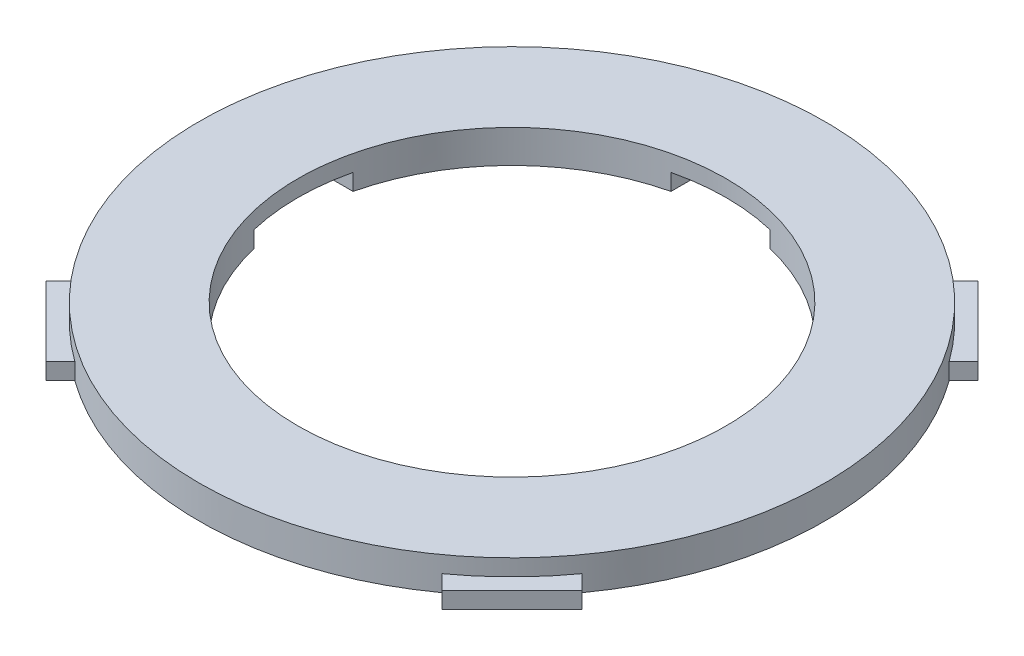
ISO-10303-21;
HEADER;
FILE_DESCRIPTION(('STEP AP214'),'2;1');
FILE_NAME('part.step','',(''),(''),'','','');
FILE_SCHEMA(('AUTOMOTIVE_DESIGN { 1 0 10303 214 1 1 1 1 }'));
ENDSEC;
DATA;
#1=APPLICATION_CONTEXT('core data for automotive mechanical design processes');
#2=APPLICATION_PROTOCOL_DEFINITION('international standard','automotive_design',2000,#1);
#3=PRODUCT_CONTEXT('',#1,'mechanical');
#4=PRODUCT('Part','Part','',(#3));
#5=PRODUCT_RELATED_PRODUCT_CATEGORY('part','',(#4));
#6=PRODUCT_DEFINITION_FORMATION('','',#4);
#7=PRODUCT_DEFINITION_CONTEXT('part definition',#1,'design');
#8=PRODUCT_DEFINITION('design','',#6,#7);
#9=PRODUCT_DEFINITION_SHAPE('','',#8);
#10=(LENGTH_UNIT() NAMED_UNIT(*) SI_UNIT(.MILLI.,.METRE.));
#11=(NAMED_UNIT(*) PLANE_ANGLE_UNIT() SI_UNIT($,.RADIAN.));
#12=(NAMED_UNIT(*) SI_UNIT($,.STERADIAN.) SOLID_ANGLE_UNIT());
#13=UNCERTAINTY_MEASURE_WITH_UNIT(LENGTH_MEASURE(1.E-05),#10,'distance_accuracy_value','');
#14=(GEOMETRIC_REPRESENTATION_CONTEXT(3) GLOBAL_UNCERTAINTY_ASSIGNED_CONTEXT((#13)) GLOBAL_UNIT_ASSIGNED_CONTEXT((#10,
#11,#12)) REPRESENTATION_CONTEXT('',''));
#15=CARTESIAN_POINT('',(0.,0.,0.));
#16=DIRECTION('',(0.,0.,1.));
#17=DIRECTION('',(1.,0.,0.));
#18=AXIS2_PLACEMENT_3D('',#15,#16,#17);
#19=CARTESIAN_POINT('',(15.,10.,0.));
#20=DIRECTION('',(-1.,0.,0.));
#21=DIRECTION('',(0.,0.,1.));
#22=AXIS2_PLACEMENT_3D('',#19,#20,#21);
#23=PLANE('',#22);
#24=DIRECTION('',(0.,-1.,0.));
#25=VECTOR('',#24,1.);
#26=CARTESIAN_POINT('',(15.,10.,70.));
#27=LINE('',#26,#25);
#28=CARTESIAN_POINT('',(15.,5.,70.));
#29=VERTEX_POINT('',#28);
#30=CARTESIAN_POINT('',(15.,0.,70.));
#31=VERTEX_POINT('',#30);
#32=EDGE_CURVE('E53',#29,#31,#27,.T.);
#33=ORIENTED_EDGE('',*,*,#32,.F.);
#34=DIRECTION('',(0.,0.,-1.));
#35=VECTOR('',#34,1.);
#36=CARTESIAN_POINT('',(15.,5.,0.));
#37=LINE('',#36,#35);
#38=CARTESIAN_POINT('',(15.,5.,63.2455532033676));
#39=VERTEX_POINT('',#38);
#40=EDGE_CURVE('E59',#29,#39,#37,.T.);
#41=ORIENTED_EDGE('',*,*,#40,.T.);
#42=DIRECTION('',(0.,-1.,0.));
#43=VECTOR('',#42,1.);
#44=CARTESIAN_POINT('',(15.,10.,63.2455532033676));
#45=LINE('',#44,#43);
#46=CARTESIAN_POINT('',(15.,0.,63.2455532033676));
#47=VERTEX_POINT('',#46);
#48=EDGE_CURVE('E11',#39,#47,#45,.T.);
#49=ORIENTED_EDGE('',*,*,#48,.T.);
#50=DIRECTION('',(0.,0.,-1.));
#51=VECTOR('',#50,1.);
#52=CARTESIAN_POINT('',(15.,0.,0.));
#53=LINE('',#52,#51);
#54=EDGE_CURVE('E442',#31,#47,#53,.T.);
#55=ORIENTED_EDGE('',*,*,#54,.F.);
#56=EDGE_LOOP('',(#33,#41,#49,#55));
#57=FACE_BOUND('',#56,.T.);
#58=ADVANCED_FACE('F45',(#57),#23,.T.);
#59=CARTESIAN_POINT('',(0.,10.,70.));
#60=DIRECTION('',(0.,0.,1.));
#61=DIRECTION('',(1.,0.,0.));
#62=AXIS2_PLACEMENT_3D('',#59,#60,#61);
#63=PLANE('',#62);
#64=DIRECTION('',(-1.,0.,0.));
#65=VECTOR('',#64,1.);
#66=CARTESIAN_POINT('',(0.,5.,70.));
#67=LINE('',#66,#65);
#68=CARTESIAN_POINT('',(-15.,5.,70.));
#69=VERTEX_POINT('',#68);
#70=EDGE_CURVE('E67',#29,#69,#67,.T.);
#71=ORIENTED_EDGE('',*,*,#70,.F.);
#72=ORIENTED_EDGE('',*,*,#32,.T.);
#73=DIRECTION('',(-1.,0.,0.));
#74=VECTOR('',#73,1.);
#75=CARTESIAN_POINT('',(0.,0.,70.));
#76=LINE('',#75,#74);
#77=CARTESIAN_POINT('',(-15.,0.,70.));
#78=VERTEX_POINT('',#77);
#79=EDGE_CURVE('E448',#31,#78,#76,.T.);
#80=ORIENTED_EDGE('',*,*,#79,.T.);
#81=DIRECTION('',(0.,-1.,0.));
#82=VECTOR('',#81,1.);
#83=CARTESIAN_POINT('',(-15.,10.,70.));
#84=LINE('',#83,#82);
#85=EDGE_CURVE('E535',#69,#78,#84,.T.);
#86=ORIENTED_EDGE('',*,*,#85,.F.);
#87=EDGE_LOOP('',(#71,#72,#80,#86));
#88=FACE_BOUND('',#87,.T.);
#89=ADVANCED_FACE('F539',(#88),#63,.F.);
#90=CARTESIAN_POINT('',(-15.,10.,0.));
#91=DIRECTION('',(-1.,0.,0.));
#92=DIRECTION('',(0.,0.,1.));
#93=AXIS2_PLACEMENT_3D('',#90,#91,#92);
#94=PLANE('',#93);
#95=DIRECTION('',(0.,0.,-1.));
#96=VECTOR('',#95,1.);
#97=CARTESIAN_POINT('',(-15.,5.,0.));
#98=LINE('',#97,#96);
#99=CARTESIAN_POINT('',(-15.,5.,63.2455532033676));
#100=VERTEX_POINT('',#99);
#101=EDGE_CURVE('E1010',#69,#100,#98,.T.);
#102=ORIENTED_EDGE('',*,*,#101,.F.);
#103=ORIENTED_EDGE('',*,*,#85,.T.);
#104=DIRECTION('',(0.,0.,-1.));
#105=VECTOR('',#104,1.);
#106=CARTESIAN_POINT('',(-15.,0.,0.));
#107=LINE('',#106,#105);
#108=CARTESIAN_POINT('',(-15.,0.,63.2455532033676));
#109=VERTEX_POINT('',#108);
#110=EDGE_CURVE('E452',#78,#109,#107,.T.);
#111=ORIENTED_EDGE('',*,*,#110,.T.);
#112=DIRECTION('',(0.,-1.,0.));
#113=VECTOR('',#112,1.);
#114=CARTESIAN_POINT('',(-15.,10.,63.2455532033676));
#115=LINE('',#114,#113);
#116=EDGE_CURVE('E532',#100,#109,#115,.T.);
#117=ORIENTED_EDGE('',*,*,#116,.F.);
#118=EDGE_LOOP('',(#102,#103,#111,#117));
#119=FACE_BOUND('',#118,.T.);
#120=ADVANCED_FACE('F627',(#119),#94,.F.);
#121=CARTESIAN_POINT('',(0.,10.,15.));
#122=DIRECTION('',(0.,0.,-1.));
#123=DIRECTION('',(-1.,0.,0.));
#124=AXIS2_PLACEMENT_3D('',#121,#122,#123);
#125=PLANE('',#124);
#126=DIRECTION('',(0.,-1.,0.));
#127=VECTOR('',#126,1.);
#128=CARTESIAN_POINT('',(-70.,10.,15.));
#129=LINE('',#128,#127);
#130=CARTESIAN_POINT('',(-70.,5.,15.));
#131=VERTEX_POINT('',#130);
#132=CARTESIAN_POINT('',(-70.,0.,15.));
#133=VERTEX_POINT('',#132);
#134=EDGE_CURVE('E526',#131,#133,#129,.T.);
#135=ORIENTED_EDGE('',*,*,#134,.F.);
#136=DIRECTION('',(1.,0.,0.));
#137=VECTOR('',#136,1.);
#138=CARTESIAN_POINT('',(0.,5.,15.));
#139=LINE('',#138,#137);
#140=CARTESIAN_POINT('',(-63.2455532033676,5.,15.));
#141=VERTEX_POINT('',#140);
#142=EDGE_CURVE('E369',#131,#141,#139,.T.);
#143=ORIENTED_EDGE('',*,*,#142,.T.);
#144=DIRECTION('',(0.,-1.,0.));
#145=VECTOR('',#144,1.);
#146=CARTESIAN_POINT('',(-63.2455532033676,10.,15.));
#147=LINE('',#146,#145);
#148=CARTESIAN_POINT('',(-63.2455532033676,0.,15.));
#149=VERTEX_POINT('',#148);
#150=EDGE_CURVE('E529',#141,#149,#147,.T.);
#151=ORIENTED_EDGE('',*,*,#150,.T.);
#152=DIRECTION('',(1.,0.,0.));
#153=VECTOR('',#152,1.);
#154=CARTESIAN_POINT('',(0.,0.,15.));
#155=LINE('',#154,#153);
#156=EDGE_CURVE('E456',#133,#149,#155,.T.);
#157=ORIENTED_EDGE('',*,*,#156,.F.);
#158=EDGE_LOOP('',(#135,#143,#151,#157));
#159=FACE_BOUND('',#158,.T.);
#160=ADVANCED_FACE('F631',(#159),#125,.T.);
#161=CARTESIAN_POINT('',(-70.,10.,0.));
#162=DIRECTION('',(-1.,0.,0.));
#163=DIRECTION('',(0.,0.,1.));
#164=AXIS2_PLACEMENT_3D('',#161,#162,#163);
#165=PLANE('',#164);
#166=DIRECTION('',(0.,0.,-1.));
#167=VECTOR('',#166,1.);
#168=CARTESIAN_POINT('',(-70.,5.,0.));
#169=LINE('',#168,#167);
#170=CARTESIAN_POINT('',(-70.,5.,-15.));
#171=VERTEX_POINT('',#170);
#172=EDGE_CURVE('E999',#131,#171,#169,.T.);
#173=ORIENTED_EDGE('',*,*,#172,.F.);
#174=ORIENTED_EDGE('',*,*,#134,.T.);
#175=DIRECTION('',(0.,0.,-1.));
#176=VECTOR('',#175,1.);
#177=CARTESIAN_POINT('',(-70.,0.,0.));
#178=LINE('',#177,#176);
#179=CARTESIAN_POINT('',(-70.,0.,-15.));
#180=VERTEX_POINT('',#179);
#181=EDGE_CURVE('E460',#133,#180,#178,.T.);
#182=ORIENTED_EDGE('',*,*,#181,.T.);
#183=DIRECTION('',(0.,-1.,0.));
#184=VECTOR('',#183,1.);
#185=CARTESIAN_POINT('',(-70.,10.,-15.));
#186=LINE('',#185,#184);
#187=EDGE_CURVE('E523',#171,#180,#186,.T.);
#188=ORIENTED_EDGE('',*,*,#187,.F.);
#189=EDGE_LOOP('',(#173,#174,#182,#188));
#190=FACE_BOUND('',#189,.T.);
#191=ADVANCED_FACE('F637',(#190),#165,.F.);
#192=CARTESIAN_POINT('',(0.,10.,-15.));
#193=DIRECTION('',(0.,0.,-1.));
#194=DIRECTION('',(-1.,0.,0.));
#195=AXIS2_PLACEMENT_3D('',#192,#193,#194);
#196=PLANE('',#195);
#197=DIRECTION('',(1.,0.,0.));
#198=VECTOR('',#197,1.);
#199=CARTESIAN_POINT('',(0.,5.,-15.));
#200=LINE('',#199,#198);
#201=CARTESIAN_POINT('',(-63.2455532033676,5.,-15.));
#202=VERTEX_POINT('',#201);
#203=EDGE_CURVE('E993',#171,#202,#200,.T.);
#204=ORIENTED_EDGE('',*,*,#203,.F.);
#205=ORIENTED_EDGE('',*,*,#187,.T.);
#206=DIRECTION('',(1.,0.,0.));
#207=VECTOR('',#206,1.);
#208=CARTESIAN_POINT('',(0.,0.,-15.));
#209=LINE('',#208,#207);
#210=CARTESIAN_POINT('',(-63.2455532033676,0.,-15.));
#211=VERTEX_POINT('',#210);
#212=EDGE_CURVE('E464',#180,#211,#209,.T.);
#213=ORIENTED_EDGE('',*,*,#212,.T.);
#214=DIRECTION('',(0.,-1.,0.));
#215=VECTOR('',#214,1.);
#216=CARTESIAN_POINT('',(-63.2455532033676,10.,-15.));
#217=LINE('',#216,#215);
#218=EDGE_CURVE('E520',#202,#211,#217,.T.);
#219=ORIENTED_EDGE('',*,*,#218,.F.);
#220=EDGE_LOOP('',(#204,#205,#213,#219));
#221=FACE_BOUND('',#220,.T.);
#222=ADVANCED_FACE('F641',(#221),#196,.F.);
#223=CARTESIAN_POINT('',(-15.,10.,0.));
#224=DIRECTION('',(1.,0.,0.));
#225=DIRECTION('',(0.,0.,-1.));
#226=AXIS2_PLACEMENT_3D('',#223,#224,#225);
#227=PLANE('',#226);
#228=DIRECTION('',(0.,-1.,0.));
#229=VECTOR('',#228,1.);
#230=CARTESIAN_POINT('',(-15.,10.,-70.));
#231=LINE('',#230,#229);
#232=CARTESIAN_POINT('',(-15.,5.,-70.));
#233=VERTEX_POINT('',#232);
#234=CARTESIAN_POINT('',(-15.,0.,-70.));
#235=VERTEX_POINT('',#234);
#236=EDGE_CURVE('E514',#233,#235,#231,.T.);
#237=ORIENTED_EDGE('',*,*,#236,.F.);
#238=DIRECTION('',(0.,0.,1.));
#239=VECTOR('',#238,1.);
#240=CARTESIAN_POINT('',(-15.,5.,0.));
#241=LINE('',#240,#239);
#242=CARTESIAN_POINT('',(-15.,5.,-63.2455532033676));
#243=VERTEX_POINT('',#242);
#244=EDGE_CURVE('E1011',#233,#243,#241,.T.);
#245=ORIENTED_EDGE('',*,*,#244,.T.);
#246=DIRECTION('',(0.,-1.,0.));
#247=VECTOR('',#246,1.);
#248=CARTESIAN_POINT('',(-15.,10.,-63.2455532033676));
#249=LINE('',#248,#247);
#250=CARTESIAN_POINT('',(-15.,0.,-63.2455532033676));
#251=VERTEX_POINT('',#250);
#252=EDGE_CURVE('E517',#243,#251,#249,.T.);
#253=ORIENTED_EDGE('',*,*,#252,.T.);
#254=DIRECTION('',(0.,0.,1.));
#255=VECTOR('',#254,1.);
#256=CARTESIAN_POINT('',(-15.,0.,0.));
#257=LINE('',#256,#255);
#258=EDGE_CURVE('E469',#235,#251,#257,.T.);
#259=ORIENTED_EDGE('',*,*,#258,.F.);
#260=EDGE_LOOP('',(#237,#245,#253,#259));
#261=FACE_BOUND('',#260,.T.);
#262=ADVANCED_FACE('F645',(#261),#227,.T.);
#263=CARTESIAN_POINT('',(0.,10.,-70.));
#264=DIRECTION('',(0.,0.,-1.));
#265=DIRECTION('',(-1.,0.,0.));
#266=AXIS2_PLACEMENT_3D('',#263,#264,#265);
#267=PLANE('',#266);
#268=DIRECTION('',(1.,0.,0.));
#269=VECTOR('',#268,1.);
#270=CARTESIAN_POINT('',(0.,5.,-70.));
#271=LINE('',#270,#269);
#272=CARTESIAN_POINT('',(15.,5.,-70.));
#273=VERTEX_POINT('',#272);
#274=EDGE_CURVE('E1020',#233,#273,#271,.T.);
#275=ORIENTED_EDGE('',*,*,#274,.F.);
#276=ORIENTED_EDGE('',*,*,#236,.T.);
#277=DIRECTION('',(1.,0.,0.));
#278=VECTOR('',#277,1.);
#279=CARTESIAN_POINT('',(0.,0.,-70.));
#280=LINE('',#279,#278);
#281=CARTESIAN_POINT('',(15.,0.,-70.));
#282=VERTEX_POINT('',#281);
#283=EDGE_CURVE('E473',#235,#282,#280,.T.);
#284=ORIENTED_EDGE('',*,*,#283,.T.);
#285=DIRECTION('',(0.,-1.,0.));
#286=VECTOR('',#285,1.);
#287=CARTESIAN_POINT('',(15.,10.,-70.));
#288=LINE('',#287,#286);
#289=EDGE_CURVE('E511',#273,#282,#288,.T.);
#290=ORIENTED_EDGE('',*,*,#289,.F.);
#291=EDGE_LOOP('',(#275,#276,#284,#290));
#292=FACE_BOUND('',#291,.T.);
#293=ADVANCED_FACE('F649',(#292),#267,.F.);
#294=CARTESIAN_POINT('',(15.,10.,0.));
#295=DIRECTION('',(1.,0.,0.));
#296=DIRECTION('',(0.,0.,-1.));
#297=AXIS2_PLACEMENT_3D('',#294,#295,#296);
#298=PLANE('',#297);
#299=DIRECTION('',(0.,0.,1.));
#300=VECTOR('',#299,1.);
#301=CARTESIAN_POINT('',(15.,5.,0.));
#302=LINE('',#301,#300);
#303=CARTESIAN_POINT('',(15.,5.,-63.2455532033676));
#304=VERTEX_POINT('',#303);
#305=EDGE_CURVE('E581',#273,#304,#302,.T.);
#306=ORIENTED_EDGE('',*,*,#305,.F.);
#307=ORIENTED_EDGE('',*,*,#289,.T.);
#308=DIRECTION('',(0.,0.,1.));
#309=VECTOR('',#308,1.);
#310=CARTESIAN_POINT('',(15.,0.,0.));
#311=LINE('',#310,#309);
#312=CARTESIAN_POINT('',(15.,0.,-63.2455532033676));
#313=VERTEX_POINT('',#312);
#314=EDGE_CURVE('E477',#282,#313,#311,.T.);
#315=ORIENTED_EDGE('',*,*,#314,.T.);
#316=DIRECTION('',(0.,-1.,0.));
#317=VECTOR('',#316,1.);
#318=CARTESIAN_POINT('',(15.,10.,-63.2455532033676));
#319=LINE('',#318,#317);
#320=EDGE_CURVE('E508',#304,#313,#319,.T.);
#321=ORIENTED_EDGE('',*,*,#320,.F.);
#322=EDGE_LOOP('',(#306,#307,#315,#321));
#323=FACE_BOUND('',#322,.T.);
#324=ADVANCED_FACE('F653',(#323),#298,.F.);
#325=CARTESIAN_POINT('',(0.,10.,-15.));
#326=DIRECTION('',(0.,0.,1.));
#327=DIRECTION('',(1.,0.,0.));
#328=AXIS2_PLACEMENT_3D('',#325,#326,#327);
#329=PLANE('',#328);
#330=DIRECTION('',(0.,-1.,0.));
#331=VECTOR('',#330,1.);
#332=CARTESIAN_POINT('',(70.,10.,-15.));
#333=LINE('',#332,#331);
#334=CARTESIAN_POINT('',(70.,5.,-15.));
#335=VERTEX_POINT('',#334);
#336=CARTESIAN_POINT('',(70.,0.,-15.));
#337=VERTEX_POINT('',#336);
#338=EDGE_CURVE('E502',#335,#337,#333,.T.);
#339=ORIENTED_EDGE('',*,*,#338,.F.);
#340=DIRECTION('',(-1.,0.,0.));
#341=VECTOR('',#340,1.);
#342=CARTESIAN_POINT('',(0.,5.,-15.));
#343=LINE('',#342,#341);
#344=CARTESIAN_POINT('',(63.2455532033676,5.,-15.));
#345=VERTEX_POINT('',#344);
#346=EDGE_CURVE('E569',#335,#345,#343,.T.);
#347=ORIENTED_EDGE('',*,*,#346,.T.);
#348=DIRECTION('',(0.,-1.,0.));
#349=VECTOR('',#348,1.);
#350=CARTESIAN_POINT('',(63.2455532033676,10.,-15.));
#351=LINE('',#350,#349);
#352=CARTESIAN_POINT('',(63.2455532033676,0.,-15.));
#353=VERTEX_POINT('',#352);
#354=EDGE_CURVE('E505',#345,#353,#351,.T.);
#355=ORIENTED_EDGE('',*,*,#354,.T.);
#356=DIRECTION('',(-1.,0.,0.));
#357=VECTOR('',#356,1.);
#358=CARTESIAN_POINT('',(0.,0.,-15.));
#359=LINE('',#358,#357);
#360=EDGE_CURVE('E481',#337,#353,#359,.T.);
#361=ORIENTED_EDGE('',*,*,#360,.F.);
#362=EDGE_LOOP('',(#339,#347,#355,#361));
#363=FACE_BOUND('',#362,.T.);
#364=ADVANCED_FACE('F568',(#363),#329,.T.);
#365=CARTESIAN_POINT('',(70.,10.,0.));
#366=DIRECTION('',(1.,0.,0.));
#367=DIRECTION('',(0.,0.,-1.));
#368=AXIS2_PLACEMENT_3D('',#365,#366,#367);
#369=PLANE('',#368);
#370=DIRECTION('',(0.,0.,1.));
#371=VECTOR('',#370,1.);
#372=CARTESIAN_POINT('',(70.,5.,0.));
#373=LINE('',#372,#371);
#374=CARTESIAN_POINT('',(70.,5.,15.));
#375=VERTEX_POINT('',#374);
#376=EDGE_CURVE('E565',#335,#375,#373,.T.);
#377=ORIENTED_EDGE('',*,*,#376,.F.);
#378=ORIENTED_EDGE('',*,*,#338,.T.);
#379=DIRECTION('',(0.,0.,1.));
#380=VECTOR('',#379,1.);
#381=CARTESIAN_POINT('',(70.,0.,0.));
#382=LINE('',#381,#380);
#383=CARTESIAN_POINT('',(70.,0.,15.));
#384=VERTEX_POINT('',#383);
#385=EDGE_CURVE('E485',#337,#384,#382,.T.);
#386=ORIENTED_EDGE('',*,*,#385,.T.);
#387=DIRECTION('',(0.,-1.,0.));
#388=VECTOR('',#387,1.);
#389=CARTESIAN_POINT('',(70.,10.,15.));
#390=LINE('',#389,#388);
#391=EDGE_CURVE('E499',#375,#384,#390,.T.);
#392=ORIENTED_EDGE('',*,*,#391,.F.);
#393=EDGE_LOOP('',(#377,#378,#386,#392));
#394=FACE_BOUND('',#393,.T.);
#395=ADVANCED_FACE('F563',(#394),#369,.F.);
#396=CARTESIAN_POINT('',(0.,10.,15.));
#397=DIRECTION('',(0.,0.,1.));
#398=DIRECTION('',(1.,0.,0.));
#399=AXIS2_PLACEMENT_3D('',#396,#397,#398);
#400=PLANE('',#399);
#401=DIRECTION('',(-1.,0.,0.));
#402=VECTOR('',#401,1.);
#403=CARTESIAN_POINT('',(0.,5.,15.));
#404=LINE('',#403,#402);
#405=CARTESIAN_POINT('',(63.2455532033676,5.,15.));
#406=VERTEX_POINT('',#405);
#407=EDGE_CURVE('E560',#375,#406,#404,.T.);
#408=ORIENTED_EDGE('',*,*,#407,.F.);
#409=ORIENTED_EDGE('',*,*,#391,.T.);
#410=DIRECTION('',(-1.,0.,0.));
#411=VECTOR('',#410,1.);
#412=CARTESIAN_POINT('',(0.,0.,15.));
#413=LINE('',#412,#411);
#414=CARTESIAN_POINT('',(63.2455532033676,0.,15.));
#415=VERTEX_POINT('',#414);
#416=EDGE_CURVE('E489',#384,#415,#413,.T.);
#417=ORIENTED_EDGE('',*,*,#416,.T.);
#418=DIRECTION('',(0.,-1.,0.));
#419=VECTOR('',#418,1.);
#420=CARTESIAN_POINT('',(63.2455532033676,10.,15.));
#421=LINE('',#420,#419);
#422=EDGE_CURVE('E438',#406,#415,#421,.T.);
#423=ORIENTED_EDGE('',*,*,#422,.F.);
#424=EDGE_LOOP('',(#408,#409,#417,#423));
#425=FACE_BOUND('',#424,.T.);
#426=ADVANCED_FACE('F557',(#425),#400,.F.);
#427=CARTESIAN_POINT('',(0.,10.,0.));
#428=DIRECTION('',(0.,-1.,0.));
#429=DIRECTION('',(0.,0.,-1.));
#430=AXIS2_PLACEMENT_3D('',#427,#428,#429);
#431=CYLINDRICAL_SURFACE('',#430,65.);
#432=ORIENTED_EDGE('',*,*,#48,.F.);
#433=CARTESIAN_POINT('',(0.,5.,0.));
#434=DIRECTION('',(0.,1.,0.));
#435=DIRECTION('',(0.,0.,1.));
#436=AXIS2_PLACEMENT_3D('',#433,#434,#435);
#437=CIRCLE('',#436,65.);
#438=EDGE_CURVE('E1007',#100,#39,#437,.T.);
#439=ORIENTED_EDGE('',*,*,#438,.F.);
#440=ORIENTED_EDGE('',*,*,#116,.T.);
#441=CARTESIAN_POINT('',(0.,0.,0.));
#442=DIRECTION('',(0.,1.,0.));
#443=DIRECTION('',(0.,0.,1.));
#444=AXIS2_PLACEMENT_3D('',#441,#442,#443);
#445=CIRCLE('',#444,65.);
#446=EDGE_CURVE('E444',#149,#109,#445,.T.);
#447=ORIENTED_EDGE('',*,*,#446,.F.);
#448=ORIENTED_EDGE('',*,*,#150,.F.);
#449=CARTESIAN_POINT('',(0.,5.,0.));
#450=DIRECTION('',(0.,1.,0.));
#451=DIRECTION('',(0.,0.,1.));
#452=AXIS2_PLACEMENT_3D('',#449,#450,#451);
#453=CIRCLE('',#452,65.);
#454=EDGE_CURVE('E991',#202,#141,#453,.T.);
#455=ORIENTED_EDGE('',*,*,#454,.F.);
#456=ORIENTED_EDGE('',*,*,#218,.T.);
#457=EDGE_CURVE('E468',#251,#211,#445,.T.);
#458=ORIENTED_EDGE('',*,*,#457,.F.);
#459=ORIENTED_EDGE('',*,*,#252,.F.);
#460=CARTESIAN_POINT('',(0.,5.,0.));
#461=DIRECTION('',(0.,1.,0.));
#462=DIRECTION('',(0.,0.,1.));
#463=AXIS2_PLACEMENT_3D('',#460,#461,#462);
#464=CIRCLE('',#463,65.);
#465=EDGE_CURVE('E576',#304,#243,#464,.T.);
#466=ORIENTED_EDGE('',*,*,#465,.F.);
#467=ORIENTED_EDGE('',*,*,#320,.T.);
#468=EDGE_CURVE('E443',#353,#313,#445,.T.);
#469=ORIENTED_EDGE('',*,*,#468,.F.);
#470=ORIENTED_EDGE('',*,*,#354,.F.);
#471=CARTESIAN_POINT('',(0.,5.,0.));
#472=DIRECTION('',(0.,1.,0.));
#473=DIRECTION('',(0.,0.,1.));
#474=AXIS2_PLACEMENT_3D('',#471,#472,#473);
#475=CIRCLE('',#474,65.);
#476=EDGE_CURVE('E574',#406,#345,#475,.T.);
#477=ORIENTED_EDGE('',*,*,#476,.F.);
#478=ORIENTED_EDGE('',*,*,#422,.T.);
#479=EDGE_CURVE('E428',#47,#415,#445,.T.);
#480=ORIENTED_EDGE('',*,*,#479,.F.);
#481=EDGE_LOOP('',(#432,#439,#440,#447,#448,#455,#456,#458,#459,#466,#467,#469,#470,#477,#478,#480));
#482=FACE_BOUND('',#481,.T.);
#483=CARTESIAN_POINT('',(0.,10.,0.));
#484=DIRECTION('',(0.,1.,0.));
#485=DIRECTION('',(0.,0.,1.));
#486=AXIS2_PLACEMENT_3D('',#483,#484,#485);
#487=CIRCLE('',#486,65.);
#488=CARTESIAN_POINT('',(0.,10.,65.));
#489=VERTEX_POINT('',#488);
#490=EDGE_CURVE('E429',#489,#489,#487,.T.);
#491=ORIENTED_EDGE('',*,*,#490,.T.);
#492=EDGE_LOOP('',(#491));
#493=FACE_BOUND('',#492,.T.);
#494=ADVANCED_FACE('F550',(#482,#493),#431,.F.);
#495=CARTESIAN_POINT('',(0.,10.,0.));
#496=DIRECTION('',(0.,-1.,0.));
#497=DIRECTION('',(0.,0.,-1.));
#498=AXIS2_PLACEMENT_3D('',#495,#496,#497);
#499=CYLINDRICAL_SURFACE('',#498,95.);
#500=CARTESIAN_POINT('',(0.,10.,0.));
#501=DIRECTION('',(0.,1.,0.));
#502=DIRECTION('',(0.,0.,1.));
#503=AXIS2_PLACEMENT_3D('',#500,#501,#502);
#504=CIRCLE('',#503,95.);
#505=CARTESIAN_POINT('',(0.,10.,95.));
#506=VERTEX_POINT('',#505);
#507=EDGE_CURVE('E433',#506,#506,#504,.T.);
#508=ORIENTED_EDGE('',*,*,#507,.F.);
#509=EDGE_LOOP('',(#508));
#510=FACE_BOUND('',#509,.T.);
#511=CARTESIAN_POINT('',(0.,0.,0.));
#512=DIRECTION('',(0.,1.,0.));
#513=DIRECTION('',(0.,0.,1.));
#514=AXIS2_PLACEMENT_3D('',#511,#512,#513);
#515=CIRCLE('',#514,95.);
#516=CARTESIAN_POINT('',(-76.9390975249063,0.,-55.7258940893096));
#517=VERTEX_POINT('',#516);
#518=CARTESIAN_POINT('',(-76.9390975249061,0.,55.7258940893099));
#519=VERTEX_POINT('',#518);
#520=EDGE_CURVE('E496',#517,#519,#515,.T.);
#521=ORIENTED_EDGE('',*,*,#520,.T.);
#522=DIRECTION('',(0.,-1.,0.));
#523=VECTOR('',#522,1.);
#524=CARTESIAN_POINT('',(-76.9390975249061,5.,55.7258940893099));
#525=LINE('',#524,#523);
#526=CARTESIAN_POINT('',(-76.9390975249061,5.,55.7258940893099));
#527=VERTEX_POINT('',#526);
#528=EDGE_CURVE('E328',#527,#519,#525,.T.);
#529=ORIENTED_EDGE('',*,*,#528,.F.);
#530=CARTESIAN_POINT('',(0.,5.,0.));
#531=DIRECTION('',(0.,1.,0.));
#532=DIRECTION('',(0.,0.,1.));
#533=AXIS2_PLACEMENT_3D('',#530,#531,#532);
#534=CIRCLE('',#533,95.);
#535=CARTESIAN_POINT('',(-55.7258940893096,5.,76.9390975249063));
#536=VERTEX_POINT('',#535);
#537=EDGE_CURVE('E347',#527,#536,#534,.T.);
#538=ORIENTED_EDGE('',*,*,#537,.T.);
#539=DIRECTION('',(0.,-1.,0.));
#540=VECTOR('',#539,1.);
#541=CARTESIAN_POINT('',(-55.7258940893096,5.,76.9390975249063));
#542=LINE('',#541,#540);
#543=CARTESIAN_POINT('',(-55.7258940893096,0.,76.9390975249063));
#544=VERTEX_POINT('',#543);
#545=EDGE_CURVE('E363',#536,#544,#542,.T.);
#546=ORIENTED_EDGE('',*,*,#545,.T.);
#547=CARTESIAN_POINT('',(55.7258940893099,0.,76.9390975249062));
#548=VERTEX_POINT('',#547);
#549=EDGE_CURVE('E493',#544,#548,#515,.T.);
#550=ORIENTED_EDGE('',*,*,#549,.T.);
#551=DIRECTION('',(0.,-1.,0.));
#552=VECTOR('',#551,1.);
#553=CARTESIAN_POINT('',(55.7258940893099,5.,76.9390975249061));
#554=LINE('',#553,#552);
#555=CARTESIAN_POINT('',(55.7258940893099,5.,76.9390975249061));
#556=VERTEX_POINT('',#555);
#557=EDGE_CURVE('E291',#556,#548,#554,.T.);
#558=ORIENTED_EDGE('',*,*,#557,.F.);
#559=CARTESIAN_POINT('',(0.,5.,0.));
#560=DIRECTION('',(0.,1.,0.));
#561=DIRECTION('',(0.,0.,1.));
#562=AXIS2_PLACEMENT_3D('',#559,#560,#561);
#563=CIRCLE('',#562,95.);
#564=CARTESIAN_POINT('',(76.9390975249063,5.,55.7258940893096));
#565=VERTEX_POINT('',#564);
#566=EDGE_CURVE('E306',#556,#565,#563,.T.);
#567=ORIENTED_EDGE('',*,*,#566,.T.);
#568=DIRECTION('',(0.,-1.,0.));
#569=VECTOR('',#568,1.);
#570=CARTESIAN_POINT('',(76.9390975249063,5.,55.7258940893096));
#571=LINE('',#570,#569);
#572=CARTESIAN_POINT('',(76.9390975249063,0.,55.7258940893096));
#573=VERTEX_POINT('',#572);
#574=EDGE_CURVE('E322',#565,#573,#571,.T.);
#575=ORIENTED_EDGE('',*,*,#574,.T.);
#576=CARTESIAN_POINT('',(76.9390975249062,0.,-55.7258940893099));
#577=VERTEX_POINT('',#576);
#578=EDGE_CURVE('E434',#573,#577,#515,.T.);
#579=ORIENTED_EDGE('',*,*,#578,.T.);
#580=DIRECTION('',(0.,-1.,0.));
#581=VECTOR('',#580,1.);
#582=CARTESIAN_POINT('',(76.9390975249061,5.,-55.7258940893099));
#583=LINE('',#582,#581);
#584=CARTESIAN_POINT('',(76.9390975249061,5.,-55.7258940893099));
#585=VERTEX_POINT('',#584);
#586=EDGE_CURVE('E266',#585,#577,#583,.T.);
#587=ORIENTED_EDGE('',*,*,#586,.F.);
#588=CARTESIAN_POINT('',(0.,5.,0.));
#589=DIRECTION('',(0.,1.,0.));
#590=DIRECTION('',(0.,0.,1.));
#591=AXIS2_PLACEMENT_3D('',#588,#589,#590);
#592=CIRCLE('',#591,95.);
#593=CARTESIAN_POINT('',(55.7258940893096,5.,-76.9390975249063));
#594=VERTEX_POINT('',#593);
#595=EDGE_CURVE('E275',#585,#594,#592,.T.);
#596=ORIENTED_EDGE('',*,*,#595,.T.);
#597=DIRECTION('',(0.,-1.,0.));
#598=VECTOR('',#597,1.);
#599=CARTESIAN_POINT('',(55.7258940893096,5.,-76.9390975249063));
#600=LINE('',#599,#598);
#601=CARTESIAN_POINT('',(55.7258940893096,0.,-76.9390975249063));
#602=VERTEX_POINT('',#601);
#603=EDGE_CURVE('E284',#594,#602,#600,.T.);
#604=ORIENTED_EDGE('',*,*,#603,.T.);
#605=CARTESIAN_POINT('',(-55.7258940893099,0.,-76.9390975249061));
#606=VERTEX_POINT('',#605);
#607=EDGE_CURVE('E592',#602,#606,#515,.T.);
#608=ORIENTED_EDGE('',*,*,#607,.T.);
#609=DIRECTION('',(0.,-1.,0.));
#610=VECTOR('',#609,1.);
#611=CARTESIAN_POINT('',(-55.7258940893099,5.,-76.9390975249061));
#612=LINE('',#611,#610);
#613=CARTESIAN_POINT('',(-55.7258940893099,5.,-76.9390975249061));
#614=VERTEX_POINT('',#613);
#615=EDGE_CURVE('E424',#614,#606,#612,.T.);
#616=ORIENTED_EDGE('',*,*,#615,.F.);
#617=CARTESIAN_POINT('',(0.,5.,0.));
#618=DIRECTION('',(0.,1.,0.));
#619=DIRECTION('',(0.,0.,1.));
#620=AXIS2_PLACEMENT_3D('',#617,#618,#619);
#621=CIRCLE('',#620,95.);
#622=CARTESIAN_POINT('',(-76.9390975249064,5.,-55.7258940893096));
#623=VERTEX_POINT('',#622);
#624=EDGE_CURVE('E388',#614,#623,#621,.T.);
#625=ORIENTED_EDGE('',*,*,#624,.T.);
#626=DIRECTION('',(0.,-1.,0.));
#627=VECTOR('',#626,1.);
#628=CARTESIAN_POINT('',(-76.9390975249063,5.,-55.7258940893096));
#629=LINE('',#628,#627);
#630=EDGE_CURVE('E404',#623,#517,#629,.T.);
#631=ORIENTED_EDGE('',*,*,#630,.T.);
#632=EDGE_LOOP('',(#521,#529,#538,#546,#550,#558,#567,#575,#579,#587,#596,#604,#608,#616,#625,#631));
#633=FACE_BOUND('',#632,.T.);
#634=ADVANCED_FACE('F587',(#510,#633),#499,.T.);
#635=CARTESIAN_POINT('',(0.,10.,0.));
#636=DIRECTION('',(0.,1.,0.));
#637=DIRECTION('',(0.,0.,1.));
#638=AXIS2_PLACEMENT_3D('',#635,#636,#637);
#639=PLANE('',#638);
#640=ORIENTED_EDGE('',*,*,#490,.F.);
#641=EDGE_LOOP('',(#640));
#642=FACE_BOUND('',#641,.T.);
#643=ORIENTED_EDGE('',*,*,#507,.T.);
#644=EDGE_LOOP('',(#643));
#645=FACE_BOUND('',#644,.T.);
#646=ADVANCED_FACE('F668',(#642,#645),#639,.T.);
#647=CARTESIAN_POINT('',(0.,0.,0.));
#648=DIRECTION('',(0.,1.,0.));
#649=DIRECTION('',(0.,0.,1.));
#650=AXIS2_PLACEMENT_3D('',#647,#648,#649);
#651=PLANE('',#650);
#652=ORIENTED_EDGE('',*,*,#479,.T.);
#653=ORIENTED_EDGE('',*,*,#416,.F.);
#654=ORIENTED_EDGE('',*,*,#385,.F.);
#655=ORIENTED_EDGE('',*,*,#360,.T.);
#656=ORIENTED_EDGE('',*,*,#468,.T.);
#657=ORIENTED_EDGE('',*,*,#314,.F.);
#658=ORIENTED_EDGE('',*,*,#283,.F.);
#659=ORIENTED_EDGE('',*,*,#258,.T.);
#660=ORIENTED_EDGE('',*,*,#457,.T.);
#661=ORIENTED_EDGE('',*,*,#212,.F.);
#662=ORIENTED_EDGE('',*,*,#181,.F.);
#663=ORIENTED_EDGE('',*,*,#156,.T.);
#664=ORIENTED_EDGE('',*,*,#446,.T.);
#665=ORIENTED_EDGE('',*,*,#110,.F.);
#666=ORIENTED_EDGE('',*,*,#79,.F.);
#667=ORIENTED_EDGE('',*,*,#54,.T.);
#668=EDGE_LOOP('',(#652,#653,#654,#655,#656,#657,#658,#659,#660,#661,#662,#663,#664,#665,#666,#667));
#669=FACE_BOUND('',#668,.T.);
#670=ORIENTED_EDGE('',*,*,#578,.F.);
#671=DIRECTION('',(-0.707106781186547,0.,-0.707106781186548));
#672=VECTOR('',#671,1.);
#673=CARTESIAN_POINT('',(10.6066017177984,0.,-10.6066017177984));
#674=LINE('',#673,#672);
#675=CARTESIAN_POINT('',(81.3172798364531,0.,60.1040764008564));
#676=VERTEX_POINT('',#675);
#677=EDGE_CURVE('E310',#676,#573,#674,.T.);
#678=ORIENTED_EDGE('',*,*,#677,.F.);
#679=DIRECTION('',(-0.707106781186547,0.,0.707106781186548));
#680=VECTOR('',#679,1.);
#681=CARTESIAN_POINT('',(70.7106781186548,0.,70.7106781186547));
#682=LINE('',#681,#680);
#683=CARTESIAN_POINT('',(60.1040764008567,0.,81.3172798364528));
#684=VERTEX_POINT('',#683);
#685=EDGE_CURVE('E327',#676,#684,#682,.T.);
#686=ORIENTED_EDGE('',*,*,#685,.T.);
#687=DIRECTION('',(-0.707106781186554,0.,-0.707106781186541));
#688=VECTOR('',#687,1.);
#689=CARTESIAN_POINT('',(-10.6066017177986,0.,10.6066017177988));
#690=LINE('',#689,#688);
#691=EDGE_CURVE('E323',#684,#548,#690,.T.);
#692=ORIENTED_EDGE('',*,*,#691,.T.);
#693=ORIENTED_EDGE('',*,*,#549,.F.);
#694=DIRECTION('',(0.707106781186547,0.,-0.707106781186548));
#695=VECTOR('',#694,1.);
#696=CARTESIAN_POINT('',(10.6066017177983,0.,10.6066017177983));
#697=LINE('',#696,#695);
#698=CARTESIAN_POINT('',(-60.1040764008564,0.,81.3172798364531));
#699=VERTEX_POINT('',#698);
#700=EDGE_CURVE('E351',#699,#544,#697,.T.);
#701=ORIENTED_EDGE('',*,*,#700,.F.);
#702=DIRECTION('',(-0.707106781186547,0.,-0.707106781186548));
#703=VECTOR('',#702,1.);
#704=CARTESIAN_POINT('',(-70.7106781186548,0.,70.7106781186548));
#705=LINE('',#704,#703);
#706=CARTESIAN_POINT('',(-81.3172798364528,0.,60.1040764008567));
#707=VERTEX_POINT('',#706);
#708=EDGE_CURVE('E368',#699,#707,#705,.T.);
#709=ORIENTED_EDGE('',*,*,#708,.T.);
#710=DIRECTION('',(0.70710678118654,0.,-0.707106781186555));
#711=VECTOR('',#710,1.);
#712=CARTESIAN_POINT('',(-10.606601717799,0.,-10.6066017177987));
#713=LINE('',#712,#711);
#714=EDGE_CURVE('E364',#707,#519,#713,.T.);
#715=ORIENTED_EDGE('',*,*,#714,.T.);
#716=ORIENTED_EDGE('',*,*,#520,.F.);
#717=DIRECTION('',(0.707106781186547,0.,0.707106781186548));
#718=VECTOR('',#717,1.);
#719=CARTESIAN_POINT('',(-10.6066017177984,0.,10.6066017177984));
#720=LINE('',#719,#718);
#721=CARTESIAN_POINT('',(-81.3172798364531,0.,-60.1040764008564));
#722=VERTEX_POINT('',#721);
#723=EDGE_CURVE('E392',#722,#517,#720,.T.);
#724=ORIENTED_EDGE('',*,*,#723,.F.);
#725=DIRECTION('',(0.707106781186547,0.,-0.707106781186548));
#726=VECTOR('',#725,1.);
#727=CARTESIAN_POINT('',(-70.7106781186548,0.,-70.7106781186548));
#728=LINE('',#727,#726);
#729=CARTESIAN_POINT('',(-60.1040764008567,0.,-81.3172798364528));
#730=VERTEX_POINT('',#729);
#731=EDGE_CURVE('E408',#722,#730,#728,.T.);
#732=ORIENTED_EDGE('',*,*,#731,.T.);
#733=DIRECTION('',(0.707106781186554,0.,0.707106781186541));
#734=VECTOR('',#733,1.);
#735=CARTESIAN_POINT('',(10.6066017177986,0.,-10.6066017177988));
#736=LINE('',#735,#734);
#737=EDGE_CURVE('E305',#730,#606,#736,.T.);
#738=ORIENTED_EDGE('',*,*,#737,.T.);
#739=ORIENTED_EDGE('',*,*,#607,.F.);
#740=DIRECTION('',(-0.707106781186548,0.,0.707106781186547));
#741=VECTOR('',#740,1.);
#742=CARTESIAN_POINT('',(-10.6066017177984,0.,-10.6066017177984));
#743=LINE('',#742,#741);
#744=CARTESIAN_POINT('',(60.1040764008564,0.,-81.3172798364531));
#745=VERTEX_POINT('',#744);
#746=EDGE_CURVE('E294',#745,#602,#743,.T.);
#747=ORIENTED_EDGE('',*,*,#746,.F.);
#748=DIRECTION('',(0.707106781186548,0.,0.707106781186547));
#749=VECTOR('',#748,1.);
#750=CARTESIAN_POINT('',(70.7106781186548,0.,-70.7106781186548));
#751=LINE('',#750,#749);
#752=CARTESIAN_POINT('',(81.3172798364528,0.,-60.1040764008567));
#753=VERTEX_POINT('',#752);
#754=EDGE_CURVE('E290',#745,#753,#751,.T.);
#755=ORIENTED_EDGE('',*,*,#754,.T.);
#756=DIRECTION('',(-0.707106781186541,0.,0.707106781186554));
#757=VECTOR('',#756,1.);
#758=CARTESIAN_POINT('',(10.6066017177988,0.,10.6066017177986));
#759=LINE('',#758,#757);
#760=EDGE_CURVE('E260',#753,#577,#759,.T.);
#761=ORIENTED_EDGE('',*,*,#760,.T.);
#762=EDGE_LOOP('',(#670,#678,#686,#692,#693,#701,#709,#715,#716,#724,#732,#738,#739,#747,#755,#761));
#763=FACE_BOUND('',#762,.T.);
#764=ADVANCED_FACE('F543',(#669,#763),#651,.F.);
#765=CARTESIAN_POINT('',(10.6066017177986,5.,-10.6066017177988));
#766=DIRECTION('',(0.707106781186541,0.,-0.707106781186554));
#767=DIRECTION('',(-0.707106781186554,0.,-0.707106781186541));
#768=AXIS2_PLACEMENT_3D('',#765,#766,#767);
#769=PLANE('',#768);
#770=ORIENTED_EDGE('',*,*,#737,.F.);
#771=DIRECTION('',(0.,-1.,0.));
#772=VECTOR('',#771,1.);
#773=CARTESIAN_POINT('',(-60.1040764008567,5.,-81.3172798364528));
#774=LINE('',#773,#772);
#775=CARTESIAN_POINT('',(-60.1040764008567,5.,-81.3172798364528));
#776=VERTEX_POINT('',#775);
#777=EDGE_CURVE('E421',#776,#730,#774,.T.);
#778=ORIENTED_EDGE('',*,*,#777,.F.);
#779=DIRECTION('',(0.707106781186554,0.,0.707106781186541));
#780=VECTOR('',#779,1.);
#781=CARTESIAN_POINT('',(10.6066017177986,5.,-10.6066017177988));
#782=LINE('',#781,#780);
#783=EDGE_CURVE('E391',#776,#614,#782,.T.);
#784=ORIENTED_EDGE('',*,*,#783,.T.);
#785=ORIENTED_EDGE('',*,*,#615,.T.);
#786=EDGE_LOOP('',(#770,#778,#784,#785));
#787=FACE_BOUND('',#786,.T.);
#788=ADVANCED_FACE('F672',(#787),#769,.T.);
#789=CARTESIAN_POINT('',(-70.7106781186548,5.,-70.7106781186548));
#790=DIRECTION('',(-0.707106781186548,0.,-0.707106781186547));
#791=DIRECTION('',(-0.707106781186547,0.,0.707106781186548));
#792=AXIS2_PLACEMENT_3D('',#789,#790,#791);
#793=PLANE('',#792);
#794=ORIENTED_EDGE('',*,*,#731,.F.);
#795=DIRECTION('',(0.,-1.,0.));
#796=VECTOR('',#795,1.);
#797=CARTESIAN_POINT('',(-81.3172798364531,5.,-60.1040764008564));
#798=LINE('',#797,#796);
#799=CARTESIAN_POINT('',(-81.3172798364531,5.,-60.1040764008564));
#800=VERTEX_POINT('',#799);
#801=EDGE_CURVE('E418',#800,#722,#798,.T.);
#802=ORIENTED_EDGE('',*,*,#801,.F.);
#803=DIRECTION('',(0.707106781186547,0.,-0.707106781186548));
#804=VECTOR('',#803,1.);
#805=CARTESIAN_POINT('',(-70.7106781186548,5.,-70.7106781186548));
#806=LINE('',#805,#804);
#807=EDGE_CURVE('E396',#800,#776,#806,.T.);
#808=ORIENTED_EDGE('',*,*,#807,.T.);
#809=ORIENTED_EDGE('',*,*,#777,.T.);
#810=EDGE_LOOP('',(#794,#802,#808,#809));
#811=FACE_BOUND('',#810,.T.);
#812=ADVANCED_FACE('F678',(#811),#793,.T.);
#813=CARTESIAN_POINT('',(-10.6066017177984,5.,10.6066017177984));
#814=DIRECTION('',(0.707106781186548,0.,-0.707106781186547));
#815=DIRECTION('',(-0.707106781186547,0.,-0.707106781186548));
#816=AXIS2_PLACEMENT_3D('',#813,#814,#815);
#817=PLANE('',#816);
#818=ORIENTED_EDGE('',*,*,#723,.T.);
#819=ORIENTED_EDGE('',*,*,#630,.F.);
#820=DIRECTION('',(0.707106781186547,0.,0.707106781186548));
#821=VECTOR('',#820,1.);
#822=CARTESIAN_POINT('',(-10.6066017177984,5.,10.6066017177984));
#823=LINE('',#822,#821);
#824=EDGE_CURVE('E400',#800,#623,#823,.T.);
#825=ORIENTED_EDGE('',*,*,#824,.F.);
#826=ORIENTED_EDGE('',*,*,#801,.T.);
#827=EDGE_LOOP('',(#818,#819,#825,#826));
#828=FACE_BOUND('',#827,.T.);
#829=ADVANCED_FACE('F682',(#828),#817,.F.);
#830=CARTESIAN_POINT('',(0.,5.,0.));
#831=DIRECTION('',(0.,1.,0.));
#832=DIRECTION('',(0.,0.,1.));
#833=AXIS2_PLACEMENT_3D('',#830,#831,#832);
#834=PLANE('',#833);
#835=ORIENTED_EDGE('',*,*,#624,.F.);
#836=ORIENTED_EDGE('',*,*,#783,.F.);
#837=ORIENTED_EDGE('',*,*,#807,.F.);
#838=ORIENTED_EDGE('',*,*,#824,.T.);
#839=EDGE_LOOP('',(#835,#836,#837,#838));
#840=FACE_BOUND('',#839,.T.);
#841=ADVANCED_FACE('F686',(#840),#834,.T.);
#842=CARTESIAN_POINT('',(10.6066017177988,5.,10.6066017177986));
#843=DIRECTION('',(0.707106781186554,0.,0.707106781186541));
#844=DIRECTION('',(0.707106781186541,0.,-0.707106781186554));
#845=AXIS2_PLACEMENT_3D('',#842,#843,#844);
#846=PLANE('',#845);
#847=ORIENTED_EDGE('',*,*,#760,.F.);
#848=DIRECTION('',(0.,-1.,0.));
#849=VECTOR('',#848,1.);
#850=CARTESIAN_POINT('',(81.3172798364528,5.,-60.1040764008567));
#851=LINE('',#850,#849);
#852=CARTESIAN_POINT('',(81.3172798364528,5.,-60.1040764008567));
#853=VERTEX_POINT('',#852);
#854=EDGE_CURVE('E254',#853,#753,#851,.T.);
#855=ORIENTED_EDGE('',*,*,#854,.F.);
#856=DIRECTION('',(-0.707106781186541,0.,0.707106781186554));
#857=VECTOR('',#856,1.);
#858=CARTESIAN_POINT('',(10.6066017177988,5.,10.6066017177986));
#859=LINE('',#858,#857);
#860=EDGE_CURVE('E258',#853,#585,#859,.T.);
#861=ORIENTED_EDGE('',*,*,#860,.T.);
#862=ORIENTED_EDGE('',*,*,#586,.T.);
#863=EDGE_LOOP('',(#847,#855,#861,#862));
#864=FACE_BOUND('',#863,.T.);
#865=ADVANCED_FACE('F256',(#864),#846,.T.);
#866=CARTESIAN_POINT('',(70.7106781186548,5.,-70.7106781186548));
#867=DIRECTION('',(0.707106781186547,0.,-0.707106781186548));
#868=DIRECTION('',(-0.707106781186548,0.,-0.707106781186547));
#869=AXIS2_PLACEMENT_3D('',#866,#867,#868);
#870=PLANE('',#869);
#871=ORIENTED_EDGE('',*,*,#754,.F.);
#872=DIRECTION('',(0.,-1.,0.));
#873=VECTOR('',#872,1.);
#874=CARTESIAN_POINT('',(60.1040764008564,5.,-81.3172798364531));
#875=LINE('',#874,#873);
#876=CARTESIAN_POINT('',(60.1040764008564,5.,-81.3172798364531));
#877=VERTEX_POINT('',#876);
#878=EDGE_CURVE('E267',#877,#745,#875,.T.);
#879=ORIENTED_EDGE('',*,*,#878,.F.);
#880=DIRECTION('',(0.707106781186548,0.,0.707106781186547));
#881=VECTOR('',#880,1.);
#882=CARTESIAN_POINT('',(70.7106781186548,5.,-70.7106781186548));
#883=LINE('',#882,#881);
#884=EDGE_CURVE('E274',#877,#853,#883,.T.);
#885=ORIENTED_EDGE('',*,*,#884,.T.);
#886=ORIENTED_EDGE('',*,*,#854,.T.);
#887=EDGE_LOOP('',(#871,#879,#885,#886));
#888=FACE_BOUND('',#887,.T.);
#889=ADVANCED_FACE('F278',(#888),#870,.T.);
#890=CARTESIAN_POINT('',(-10.6066017177984,5.,-10.6066017177984));
#891=DIRECTION('',(0.707106781186547,0.,0.707106781186548));
#892=DIRECTION('',(0.707106781186548,0.,-0.707106781186547));
#893=AXIS2_PLACEMENT_3D('',#890,#891,#892);
#894=PLANE('',#893);
#895=ORIENTED_EDGE('',*,*,#746,.T.);
#896=ORIENTED_EDGE('',*,*,#603,.F.);
#897=DIRECTION('',(-0.707106781186548,0.,0.707106781186547));
#898=VECTOR('',#897,1.);
#899=CARTESIAN_POINT('',(-10.6066017177984,5.,-10.6066017177984));
#900=LINE('',#899,#898);
#901=EDGE_CURVE('E281',#877,#594,#900,.T.);
#902=ORIENTED_EDGE('',*,*,#901,.F.);
#903=ORIENTED_EDGE('',*,*,#878,.T.);
#904=EDGE_LOOP('',(#895,#896,#902,#903));
#905=FACE_BOUND('',#904,.T.);
#906=ADVANCED_FACE('F590',(#905),#894,.F.);
#907=CARTESIAN_POINT('',(0.,5.,0.));
#908=DIRECTION('',(0.,1.,0.));
#909=DIRECTION('',(0.,0.,1.));
#910=AXIS2_PLACEMENT_3D('',#907,#908,#909);
#911=PLANE('',#910);
#912=ORIENTED_EDGE('',*,*,#595,.F.);
#913=ORIENTED_EDGE('',*,*,#860,.F.);
#914=ORIENTED_EDGE('',*,*,#884,.F.);
#915=ORIENTED_EDGE('',*,*,#901,.T.);
#916=EDGE_LOOP('',(#912,#913,#914,#915));
#917=FACE_BOUND('',#916,.T.);
#918=ADVANCED_FACE('F272',(#917),#911,.T.);
#919=CARTESIAN_POINT('',(-10.6066017177986,5.,10.6066017177988));
#920=DIRECTION('',(-0.707106781186541,0.,0.707106781186554));
#921=DIRECTION('',(0.707106781186554,0.,0.707106781186541));
#922=AXIS2_PLACEMENT_3D('',#919,#920,#921);
#923=PLANE('',#922);
#924=ORIENTED_EDGE('',*,*,#691,.F.);
#925=DIRECTION('',(0.,-1.,0.));
#926=VECTOR('',#925,1.);
#927=CARTESIAN_POINT('',(60.1040764008567,5.,81.3172798364528));
#928=LINE('',#927,#926);
#929=CARTESIAN_POINT('',(60.1040764008567,5.,81.3172798364528));
#930=VERTEX_POINT('',#929);
#931=EDGE_CURVE('E341',#930,#684,#928,.T.);
#932=ORIENTED_EDGE('',*,*,#931,.F.);
#933=DIRECTION('',(-0.707106781186554,0.,-0.707106781186541));
#934=VECTOR('',#933,1.);
#935=CARTESIAN_POINT('',(-10.6066017177986,5.,10.6066017177988));
#936=LINE('',#935,#934);
#937=EDGE_CURVE('E309',#930,#556,#936,.T.);
#938=ORIENTED_EDGE('',*,*,#937,.T.);
#939=ORIENTED_EDGE('',*,*,#557,.T.);
#940=EDGE_LOOP('',(#924,#932,#938,#939));
#941=FACE_BOUND('',#940,.T.);
#942=ADVANCED_FACE('F711',(#941),#923,.T.);
#943=CARTESIAN_POINT('',(70.7106781186548,5.,70.7106781186547));
#944=DIRECTION('',(0.707106781186548,0.,0.707106781186547));
#945=DIRECTION('',(0.707106781186547,0.,-0.707106781186548));
#946=AXIS2_PLACEMENT_3D('',#943,#944,#945);
#947=PLANE('',#946);
#948=ORIENTED_EDGE('',*,*,#685,.F.);
#949=DIRECTION('',(0.,-1.,0.));
#950=VECTOR('',#949,1.);
#951=CARTESIAN_POINT('',(81.3172798364531,5.,60.1040764008564));
#952=LINE('',#951,#950);
#953=CARTESIAN_POINT('',(81.3172798364531,5.,60.1040764008564));
#954=VERTEX_POINT('',#953);
#955=EDGE_CURVE('E338',#954,#676,#952,.T.);
#956=ORIENTED_EDGE('',*,*,#955,.F.);
#957=DIRECTION('',(-0.707106781186547,0.,0.707106781186548));
#958=VECTOR('',#957,1.);
#959=CARTESIAN_POINT('',(70.7106781186548,5.,70.7106781186547));
#960=LINE('',#959,#958);
#961=EDGE_CURVE('E314',#954,#930,#960,.T.);
#962=ORIENTED_EDGE('',*,*,#961,.T.);
#963=ORIENTED_EDGE('',*,*,#931,.T.);
#964=EDGE_LOOP('',(#948,#956,#962,#963));
#965=FACE_BOUND('',#964,.T.);
#966=ADVANCED_FACE('F702',(#965),#947,.T.);
#967=CARTESIAN_POINT('',(10.6066017177984,5.,-10.6066017177984));
#968=DIRECTION('',(-0.707106781186548,0.,0.707106781186547));
#969=DIRECTION('',(0.707106781186547,0.,0.707106781186548));
#970=AXIS2_PLACEMENT_3D('',#967,#968,#969);
#971=PLANE('',#970);
#972=ORIENTED_EDGE('',*,*,#677,.T.);
#973=ORIENTED_EDGE('',*,*,#574,.F.);
#974=DIRECTION('',(-0.707106781186547,0.,-0.707106781186548));
#975=VECTOR('',#974,1.);
#976=CARTESIAN_POINT('',(10.6066017177984,5.,-10.6066017177984));
#977=LINE('',#976,#975);
#978=EDGE_CURVE('E318',#954,#565,#977,.T.);
#979=ORIENTED_EDGE('',*,*,#978,.F.);
#980=ORIENTED_EDGE('',*,*,#955,.T.);
#981=EDGE_LOOP('',(#972,#973,#979,#980));
#982=FACE_BOUND('',#981,.T.);
#983=ADVANCED_FACE('F696',(#982),#971,.F.);
#984=CARTESIAN_POINT('',(0.,5.,0.));
#985=DIRECTION('',(0.,1.,0.));
#986=DIRECTION('',(0.,0.,1.));
#987=AXIS2_PLACEMENT_3D('',#984,#985,#986);
#988=PLANE('',#987);
#989=ORIENTED_EDGE('',*,*,#566,.F.);
#990=ORIENTED_EDGE('',*,*,#937,.F.);
#991=ORIENTED_EDGE('',*,*,#961,.F.);
#992=ORIENTED_EDGE('',*,*,#978,.T.);
#993=EDGE_LOOP('',(#989,#990,#991,#992));
#994=FACE_BOUND('',#993,.T.);
#995=ADVANCED_FACE('F692',(#994),#988,.T.);
#996=CARTESIAN_POINT('',(-10.606601717799,5.,-10.6066017177987));
#997=DIRECTION('',(-0.707106781186555,0.,-0.70710678118654));
#998=DIRECTION('',(-0.70710678118654,0.,0.707106781186555));
#999=AXIS2_PLACEMENT_3D('',#996,#997,#998);
#1000=PLANE('',#999);
#1001=ORIENTED_EDGE('',*,*,#714,.F.);
#1002=DIRECTION('',(0.,-1.,0.));
#1003=VECTOR('',#1002,1.);
#1004=CARTESIAN_POINT('',(-81.3172798364528,5.,60.1040764008567));
#1005=LINE('',#1004,#1003);
#1006=CARTESIAN_POINT('',(-81.3172798364528,5.,60.1040764008567));
#1007=VERTEX_POINT('',#1006);
#1008=EDGE_CURVE('E382',#1007,#707,#1005,.T.);
#1009=ORIENTED_EDGE('',*,*,#1008,.F.);
#1010=DIRECTION('',(0.70710678118654,0.,-0.707106781186555));
#1011=VECTOR('',#1010,1.);
#1012=CARTESIAN_POINT('',(-10.606601717799,5.,-10.6066017177987));
#1013=LINE('',#1012,#1011);
#1014=EDGE_CURVE('E350',#1007,#527,#1013,.T.);
#1015=ORIENTED_EDGE('',*,*,#1014,.T.);
#1016=ORIENTED_EDGE('',*,*,#528,.T.);
#1017=EDGE_LOOP('',(#1001,#1009,#1015,#1016));
#1018=FACE_BOUND('',#1017,.T.);
#1019=ADVANCED_FACE('F602',(#1018),#1000,.T.);
#1020=CARTESIAN_POINT('',(-70.7106781186548,5.,70.7106781186548));
#1021=DIRECTION('',(-0.707106781186548,0.,0.707106781186547));
#1022=DIRECTION('',(0.707106781186547,0.,0.707106781186548));
#1023=AXIS2_PLACEMENT_3D('',#1020,#1021,#1022);
#1024=PLANE('',#1023);
#1025=ORIENTED_EDGE('',*,*,#708,.F.);
#1026=DIRECTION('',(0.,-1.,0.));
#1027=VECTOR('',#1026,1.);
#1028=CARTESIAN_POINT('',(-60.1040764008564,5.,81.3172798364531));
#1029=LINE('',#1028,#1027);
#1030=CARTESIAN_POINT('',(-60.1040764008564,5.,81.3172798364531));
#1031=VERTEX_POINT('',#1030);
#1032=EDGE_CURVE('E379',#1031,#699,#1029,.T.);
#1033=ORIENTED_EDGE('',*,*,#1032,.F.);
#1034=DIRECTION('',(-0.707106781186547,0.,-0.707106781186548));
#1035=VECTOR('',#1034,1.);
#1036=CARTESIAN_POINT('',(-70.7106781186548,5.,70.7106781186548));
#1037=LINE('',#1036,#1035);
#1038=EDGE_CURVE('E355',#1031,#1007,#1037,.T.);
#1039=ORIENTED_EDGE('',*,*,#1038,.T.);
#1040=ORIENTED_EDGE('',*,*,#1008,.T.);
#1041=EDGE_LOOP('',(#1025,#1033,#1039,#1040));
#1042=FACE_BOUND('',#1041,.T.);
#1043=ADVANCED_FACE('F607',(#1042),#1024,.T.);
#1044=CARTESIAN_POINT('',(10.6066017177983,5.,10.6066017177983));
#1045=DIRECTION('',(-0.707106781186548,0.,-0.707106781186547));
#1046=DIRECTION('',(-0.707106781186547,0.,0.707106781186548));
#1047=AXIS2_PLACEMENT_3D('',#1044,#1045,#1046);
#1048=PLANE('',#1047);
#1049=ORIENTED_EDGE('',*,*,#700,.T.);
#1050=ORIENTED_EDGE('',*,*,#545,.F.);
#1051=DIRECTION('',(0.707106781186547,0.,-0.707106781186548));
#1052=VECTOR('',#1051,1.);
#1053=CARTESIAN_POINT('',(10.6066017177983,5.,10.6066017177983));
#1054=LINE('',#1053,#1052);
#1055=EDGE_CURVE('E359',#1031,#536,#1054,.T.);
#1056=ORIENTED_EDGE('',*,*,#1055,.F.);
#1057=ORIENTED_EDGE('',*,*,#1032,.T.);
#1058=EDGE_LOOP('',(#1049,#1050,#1056,#1057));
#1059=FACE_BOUND('',#1058,.T.);
#1060=ADVANCED_FACE('F614',(#1059),#1048,.F.);
#1061=CARTESIAN_POINT('',(0.,5.,0.));
#1062=DIRECTION('',(0.,1.,0.));
#1063=DIRECTION('',(0.,0.,1.));
#1064=AXIS2_PLACEMENT_3D('',#1061,#1062,#1063);
#1065=PLANE('',#1064);
#1066=ORIENTED_EDGE('',*,*,#537,.F.);
#1067=ORIENTED_EDGE('',*,*,#1014,.F.);
#1068=ORIENTED_EDGE('',*,*,#1038,.F.);
#1069=ORIENTED_EDGE('',*,*,#1055,.T.);
#1070=EDGE_LOOP('',(#1066,#1067,#1068,#1069));
#1071=FACE_BOUND('',#1070,.T.);
#1072=ADVANCED_FACE('F611',(#1071),#1065,.T.);
#1073=CARTESIAN_POINT('',(0.,5.,0.));
#1074=DIRECTION('',(0.,1.,0.));
#1075=DIRECTION('',(0.,0.,1.));
#1076=AXIS2_PLACEMENT_3D('',#1073,#1074,#1075);
#1077=PLANE('',#1076);
#1078=ORIENTED_EDGE('',*,*,#476,.T.);
#1079=ORIENTED_EDGE('',*,*,#346,.F.);
#1080=ORIENTED_EDGE('',*,*,#376,.T.);
#1081=ORIENTED_EDGE('',*,*,#407,.T.);
#1082=EDGE_LOOP('',(#1078,#1079,#1080,#1081));
#1083=FACE_BOUND('',#1082,.T.);
#1084=ADVANCED_FACE('F573',(#1083),#1077,.F.);
#1085=CARTESIAN_POINT('',(0.,5.,0.));
#1086=DIRECTION('',(0.,1.,0.));
#1087=DIRECTION('',(0.,0.,1.));
#1088=AXIS2_PLACEMENT_3D('',#1085,#1086,#1087);
#1089=PLANE('',#1088);
#1090=ORIENTED_EDGE('',*,*,#465,.T.);
#1091=ORIENTED_EDGE('',*,*,#244,.F.);
#1092=ORIENTED_EDGE('',*,*,#274,.T.);
#1093=ORIENTED_EDGE('',*,*,#305,.T.);
#1094=EDGE_LOOP('',(#1090,#1091,#1092,#1093));
#1095=FACE_BOUND('',#1094,.T.);
#1096=ADVANCED_FACE('F927',(#1095),#1089,.F.);
#1097=CARTESIAN_POINT('',(0.,5.,0.));
#1098=DIRECTION('',(0.,1.,0.));
#1099=DIRECTION('',(0.,0.,1.));
#1100=AXIS2_PLACEMENT_3D('',#1097,#1098,#1099);
#1101=PLANE('',#1100);
#1102=ORIENTED_EDGE('',*,*,#438,.T.);
#1103=ORIENTED_EDGE('',*,*,#40,.F.);
#1104=ORIENTED_EDGE('',*,*,#70,.T.);
#1105=ORIENTED_EDGE('',*,*,#101,.T.);
#1106=EDGE_LOOP('',(#1102,#1103,#1104,#1105));
#1107=FACE_BOUND('',#1106,.T.);
#1108=ADVANCED_FACE('F935',(#1107),#1101,.F.);
#1109=CARTESIAN_POINT('',(0.,5.,0.));
#1110=DIRECTION('',(0.,1.,0.));
#1111=DIRECTION('',(0.,0.,1.));
#1112=AXIS2_PLACEMENT_3D('',#1109,#1110,#1111);
#1113=PLANE('',#1112);
#1114=ORIENTED_EDGE('',*,*,#454,.T.);
#1115=ORIENTED_EDGE('',*,*,#142,.F.);
#1116=ORIENTED_EDGE('',*,*,#172,.T.);
#1117=ORIENTED_EDGE('',*,*,#203,.T.);
#1118=EDGE_LOOP('',(#1114,#1115,#1116,#1117));
#1119=FACE_BOUND('',#1118,.T.);
#1120=ADVANCED_FACE('F943',(#1119),#1113,.F.);
#1121=CLOSED_SHELL('',(#58,#89,#120,#160,#191,#222,#262,#293,#324,#364,#395,#426,#494,#634,#646,
#764,#788,#812,#829,#841,#865,#889,#906,#918,#942,#966,#983,#995,#1019,#1043,#1060,#1072,#1084,
#1096,#1108,#1120));
#1122=MANIFOLD_SOLID_BREP('B2',#1121);
#1123=ADVANCED_BREP_SHAPE_REPRESENTATION('',(#18,#1122),#14);
#1124=SHAPE_DEFINITION_REPRESENTATION(#9,#1123);
ENDSEC;
END-ISO-10303-21;
